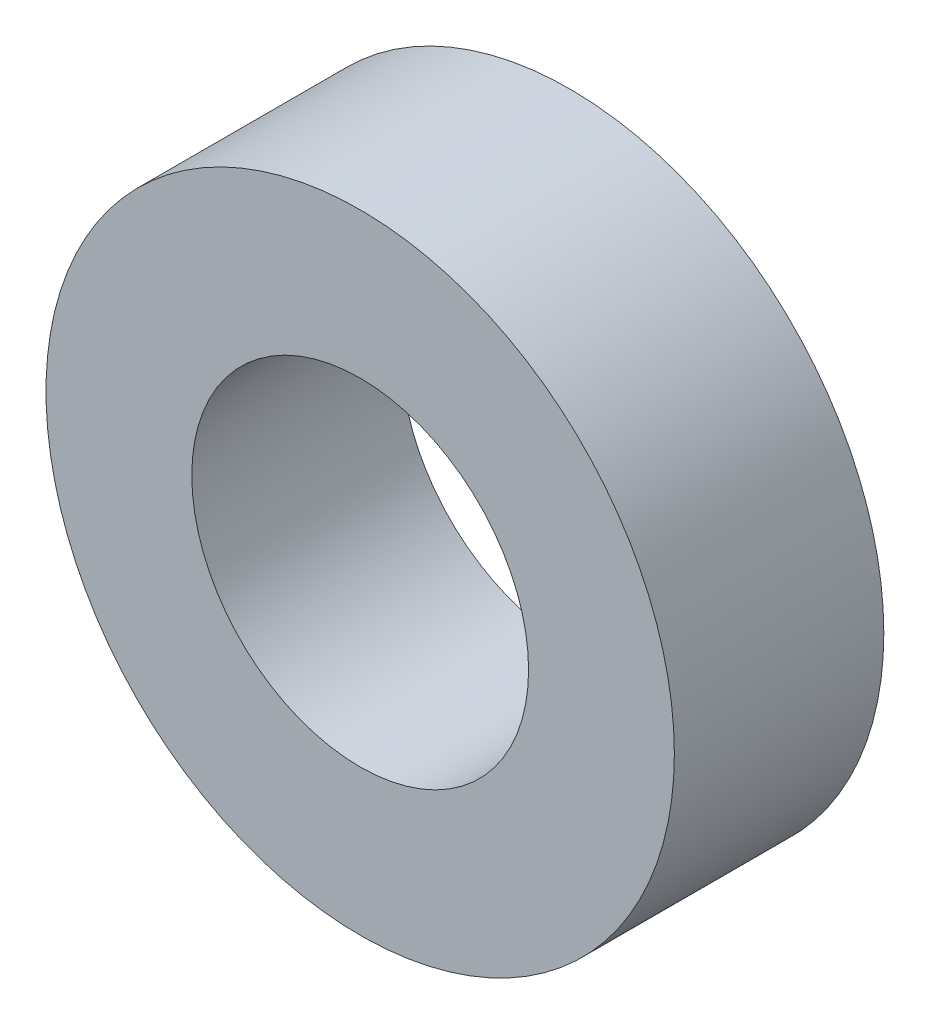
ISO-10303-21;
HEADER;
FILE_DESCRIPTION(('STEP AP214'),'2;1');
FILE_NAME('part.step','',(''),(''),'','','');
FILE_SCHEMA(('AUTOMOTIVE_DESIGN { 1 0 10303 214 1 1 1 1 }'));
ENDSEC;
DATA;
#1=APPLICATION_CONTEXT('core data for automotive mechanical design processes');
#2=APPLICATION_PROTOCOL_DEFINITION('international standard','automotive_design',2000,#1);
#3=PRODUCT_CONTEXT('',#1,'mechanical');
#4=PRODUCT('Part','Part','',(#3));
#5=PRODUCT_RELATED_PRODUCT_CATEGORY('part','',(#4));
#6=PRODUCT_DEFINITION_FORMATION('','',#4);
#7=PRODUCT_DEFINITION_CONTEXT('part definition',#1,'design');
#8=PRODUCT_DEFINITION('design','',#6,#7);
#9=PRODUCT_DEFINITION_SHAPE('','',#8);
#10=(LENGTH_UNIT() NAMED_UNIT(*) SI_UNIT(.MILLI.,.METRE.));
#11=(NAMED_UNIT(*) PLANE_ANGLE_UNIT() SI_UNIT($,.RADIAN.));
#12=(NAMED_UNIT(*) SI_UNIT($,.STERADIAN.) SOLID_ANGLE_UNIT());
#13=UNCERTAINTY_MEASURE_WITH_UNIT(LENGTH_MEASURE(1.E-05),#10,'distance_accuracy_value','');
#14=(GEOMETRIC_REPRESENTATION_CONTEXT(3) GLOBAL_UNCERTAINTY_ASSIGNED_CONTEXT((#13)) GLOBAL_UNIT_ASSIGNED_CONTEXT((#10,
#11,#12)) REPRESENTATION_CONTEXT('',''));
#15=CARTESIAN_POINT('',(0.,0.,0.));
#16=DIRECTION('',(0.,0.,1.));
#17=DIRECTION('',(1.,0.,0.));
#18=AXIS2_PLACEMENT_3D('',#15,#16,#17);
#19=CARTESIAN_POINT('',(0.,0.,3.175));
#20=DIRECTION('',(0.,0.,1.));
#21=DIRECTION('',(1.,0.,0.));
#22=AXIS2_PLACEMENT_3D('',#19,#20,#21);
#23=PLANE('',#22);
#24=CARTESIAN_POINT('',(0.,0.,3.175));
#25=DIRECTION('',(0.,0.,1.));
#26=DIRECTION('',(1.,0.,0.));
#27=AXIS2_PLACEMENT_3D('',#24,#25,#26);
#28=CIRCLE('',#27,4.7625);
#29=CARTESIAN_POINT('',(4.7625,0.,3.175));
#30=VERTEX_POINT('',#29);
#31=EDGE_CURVE('E10',#30,#30,#28,.T.);
#32=ORIENTED_EDGE('',*,*,#31,.T.);
#33=EDGE_LOOP('',(#32));
#34=FACE_BOUND('',#33,.T.);
#35=CARTESIAN_POINT('',(0.,0.,3.175));
#36=DIRECTION('',(0.,0.,1.));
#37=DIRECTION('',(1.,0.,0.));
#38=AXIS2_PLACEMENT_3D('',#35,#36,#37);
#39=CIRCLE('',#38,2.5527);
#40=CARTESIAN_POINT('',(2.5527,0.,3.175));
#41=VERTEX_POINT('',#40);
#42=EDGE_CURVE('E50',#41,#41,#39,.T.);
#43=ORIENTED_EDGE('',*,*,#42,.F.);
#44=EDGE_LOOP('',(#43));
#45=FACE_BOUND('',#44,.T.);
#46=ADVANCED_FACE('F37',(#34,#45),#23,.T.);
#47=CARTESIAN_POINT('',(0.,0.,0.));
#48=DIRECTION('',(0.,0.,1.));
#49=DIRECTION('',(1.,0.,0.));
#50=AXIS2_PLACEMENT_3D('',#47,#48,#49);
#51=PLANE('',#50);
#52=CARTESIAN_POINT('',(0.,0.,0.));
#53=DIRECTION('',(0.,0.,1.));
#54=DIRECTION('',(1.,0.,0.));
#55=AXIS2_PLACEMENT_3D('',#52,#53,#54);
#56=CIRCLE('',#55,4.7625);
#57=CARTESIAN_POINT('',(4.7625,0.,0.));
#58=VERTEX_POINT('',#57);
#59=EDGE_CURVE('E41',#58,#58,#56,.T.);
#60=ORIENTED_EDGE('',*,*,#59,.F.);
#61=EDGE_LOOP('',(#60));
#62=FACE_BOUND('',#61,.T.);
#63=CARTESIAN_POINT('',(0.,0.,0.));
#64=DIRECTION('',(0.,0.,1.));
#65=DIRECTION('',(1.,0.,0.));
#66=AXIS2_PLACEMENT_3D('',#63,#64,#65);
#67=CIRCLE('',#66,2.5527);
#68=CARTESIAN_POINT('',(2.5527,0.,0.));
#69=VERTEX_POINT('',#68);
#70=EDGE_CURVE('E52',#69,#69,#67,.T.);
#71=ORIENTED_EDGE('',*,*,#70,.T.);
#72=EDGE_LOOP('',(#71));
#73=FACE_BOUND('',#72,.T.);
#74=ADVANCED_FACE('F64',(#62,#73),#51,.F.);
#75=CARTESIAN_POINT('',(0.,0.,3.175));
#76=DIRECTION('',(0.,0.,-1.));
#77=DIRECTION('',(-1.,0.,0.));
#78=AXIS2_PLACEMENT_3D('',#75,#76,#77);
#79=CYLINDRICAL_SURFACE('',#78,4.7625);
#80=ORIENTED_EDGE('',*,*,#31,.F.);
#81=EDGE_LOOP('',(#80));
#82=FACE_BOUND('',#81,.T.);
#83=ORIENTED_EDGE('',*,*,#59,.T.);
#84=EDGE_LOOP('',(#83));
#85=FACE_BOUND('',#84,.T.);
#86=ADVANCED_FACE('F39',(#82,#85),#79,.T.);
#87=CARTESIAN_POINT('',(0.,0.,3.175));
#88=DIRECTION('',(0.,0.,-1.));
#89=DIRECTION('',(-1.,0.,0.));
#90=AXIS2_PLACEMENT_3D('',#87,#88,#89);
#91=CYLINDRICAL_SURFACE('',#90,2.5527);
#92=ORIENTED_EDGE('',*,*,#42,.T.);
#93=EDGE_LOOP('',(#92));
#94=FACE_BOUND('',#93,.T.);
#95=ORIENTED_EDGE('',*,*,#70,.F.);
#96=EDGE_LOOP('',(#95));
#97=FACE_BOUND('',#96,.T.);
#98=ADVANCED_FACE('F60',(#94,#97),#91,.F.);
#99=CLOSED_SHELL('',(#46,#74,#86,#98));
#100=MANIFOLD_SOLID_BREP('B2',#99);
#101=ADVANCED_BREP_SHAPE_REPRESENTATION('',(#18,#100),#14);
#102=SHAPE_DEFINITION_REPRESENTATION(#9,#101);
ENDSEC;
END-ISO-10303-21;
